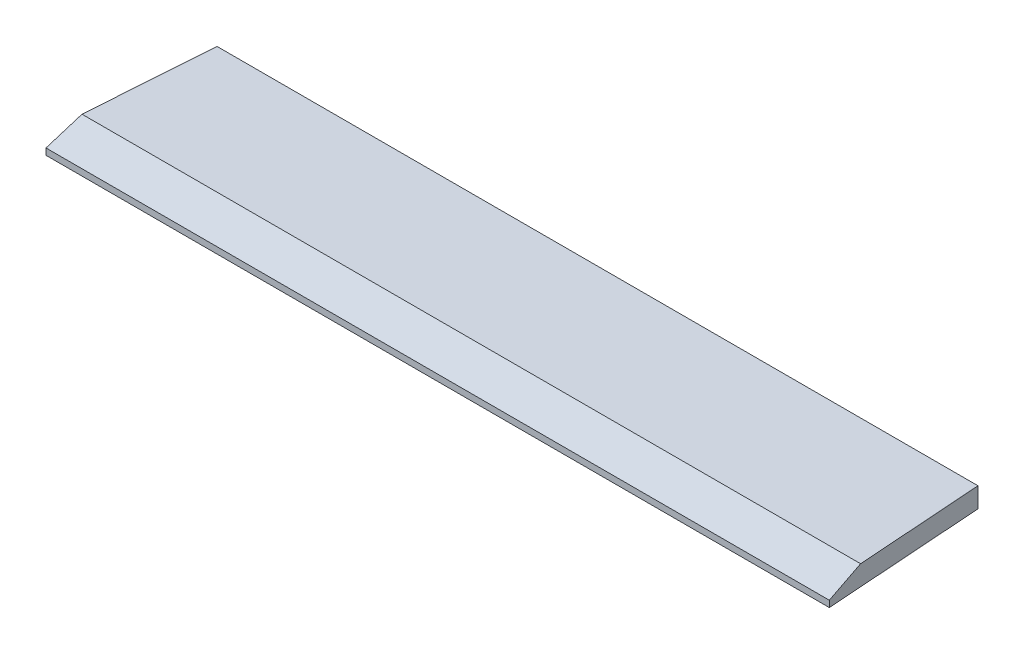
ISO-10303-21;
HEADER;
FILE_DESCRIPTION(('STEP AP214'),'2;1');
FILE_NAME('part.step','',(''),(''),'','','');
FILE_SCHEMA(('AUTOMOTIVE_DESIGN { 1 0 10303 214 1 1 1 1 }'));
ENDSEC;
DATA;
#1=APPLICATION_CONTEXT('core data for automotive mechanical design processes');
#2=APPLICATION_PROTOCOL_DEFINITION('international standard','automotive_design',2000,#1);
#3=PRODUCT_CONTEXT('',#1,'mechanical');
#4=PRODUCT('Part','Part','',(#3));
#5=PRODUCT_RELATED_PRODUCT_CATEGORY('part','',(#4));
#6=PRODUCT_DEFINITION_FORMATION('','',#4);
#7=PRODUCT_DEFINITION_CONTEXT('part definition',#1,'design');
#8=PRODUCT_DEFINITION('design','',#6,#7);
#9=PRODUCT_DEFINITION_SHAPE('','',#8);
#10=(LENGTH_UNIT() NAMED_UNIT(*) SI_UNIT(.MILLI.,.METRE.));
#11=(NAMED_UNIT(*) PLANE_ANGLE_UNIT() SI_UNIT($,.RADIAN.));
#12=(NAMED_UNIT(*) SI_UNIT($,.STERADIAN.) SOLID_ANGLE_UNIT());
#13=UNCERTAINTY_MEASURE_WITH_UNIT(LENGTH_MEASURE(1.E-05),#10,'distance_accuracy_value','');
#14=(GEOMETRIC_REPRESENTATION_CONTEXT(3) GLOBAL_UNCERTAINTY_ASSIGNED_CONTEXT((#13)) GLOBAL_UNIT_ASSIGNED_CONTEXT((#10,
#11,#12)) REPRESENTATION_CONTEXT('',''));
#15=CARTESIAN_POINT('',(0.,0.,0.));
#16=DIRECTION('',(0.,0.,1.));
#17=DIRECTION('',(1.,0.,0.));
#18=AXIS2_PLACEMENT_3D('',#15,#16,#17);
#19=CARTESIAN_POINT('',(490.,9.99999999999997,157.923523491922));
#20=DIRECTION('',(0.,-0.927183854566789,-0.374606593415907));
#21=DIRECTION('',(0.,0.374606593415907,-0.92718385456679));
#22=AXIS2_PLACEMENT_3D('',#19,#20,#21);
#23=PLANE('',#22);
#24=DIRECTION('',(-1.,0.,0.));
#25=VECTOR('',#24,1.);
#26=CARTESIAN_POINT('',(490.,-7.,200.));
#27=LINE('',#26,#25);
#28=CARTESIAN_POINT('',(490.,-7.,200.));
#29=VERTEX_POINT('',#28);
#30=CARTESIAN_POINT('',(-490.,-6.9999999999999,200.));
#31=VERTEX_POINT('',#30);
#32=EDGE_CURVE('E11',#29,#31,#27,.T.);
#33=ORIENTED_EDGE('',*,*,#32,.F.);
#34=DIRECTION('',(-0.0646991696164353,0.373821722859536,-0.925241231771083));
#35=VECTOR('',#34,1.);
#36=CARTESIAN_POINT('',(487.070042447007,9.92883829666601,158.099654888311));
#37=LINE('',#36,#35);
#38=CARTESIAN_POINT('',(487.057726139974,9.99999999999997,157.923523491922));
#39=VERTEX_POINT('',#38);
#40=EDGE_CURVE('E58',#29,#39,#37,.T.);
#41=ORIENTED_EDGE('',*,*,#40,.T.);
#42=DIRECTION('',(-1.,0.,0.));
#43=VECTOR('',#42,1.);
#44=CARTESIAN_POINT('',(490.,9.99999999999997,157.923523491922));
#45=LINE('',#44,#43);
#46=CARTESIAN_POINT('',(-487.057726139974,9.99999999999997,157.923523491922));
#47=VERTEX_POINT('',#46);
#48=EDGE_CURVE('E100',#39,#47,#45,.T.);
#49=ORIENTED_EDGE('',*,*,#48,.T.);
#50=DIRECTION('',(-0.0646991696164353,-0.373821722859536,0.925241231771083));
#51=VECTOR('',#50,1.);
#52=CARTESIAN_POINT('',(-482.967779548932,33.6310742491913,99.4345622856436));
#53=LINE('',#52,#51);
#54=EDGE_CURVE('E120',#47,#31,#53,.T.);
#55=ORIENTED_EDGE('',*,*,#54,.T.);
#56=EDGE_LOOP('',(#33,#41,#49,#55));
#57=FACE_BOUND('',#56,.T.);
#58=ADVANCED_FACE('F36',(#57),#23,.F.);
#59=CARTESIAN_POINT('',(490.,-7.,200.));
#60=DIRECTION('',(0.,0.,-1.));
#61=DIRECTION('',(-1.,0.,0.));
#62=AXIS2_PLACEMENT_3D('',#59,#60,#61);
#63=PLANE('',#62);
#64=DIRECTION('',(0.,-1.,0.));
#65=VECTOR('',#64,1.);
#66=CARTESIAN_POINT('',(-490.,-7.,200.));
#67=LINE('',#66,#65);
#68=CARTESIAN_POINT('',(-490.,-15.,200.));
#69=VERTEX_POINT('',#68);
#70=EDGE_CURVE('E88',#31,#69,#67,.T.);
#71=ORIENTED_EDGE('',*,*,#70,.T.);
#72=DIRECTION('',(-1.,0.,0.));
#73=VECTOR('',#72,1.);
#74=CARTESIAN_POINT('',(490.,-15.,200.));
#75=LINE('',#74,#73);
#76=CARTESIAN_POINT('',(490.,-14.9999999999999,200.));
#77=VERTEX_POINT('',#76);
#78=EDGE_CURVE('E43',#77,#69,#75,.T.);
#79=ORIENTED_EDGE('',*,*,#78,.F.);
#80=DIRECTION('',(0.,-1.,0.));
#81=VECTOR('',#80,1.);
#82=CARTESIAN_POINT('',(490.,-7.,200.));
#83=LINE('',#82,#81);
#84=EDGE_CURVE('E87',#29,#77,#83,.T.);
#85=ORIENTED_EDGE('',*,*,#84,.F.);
#86=ORIENTED_EDGE('',*,*,#32,.T.);
#87=EDGE_LOOP('',(#71,#79,#85,#86));
#88=FACE_BOUND('',#87,.T.);
#89=ADVANCED_FACE('F85',(#88),#63,.F.);
#90=CARTESIAN_POINT('',(490.,-15.,200.));
#91=DIRECTION('',(0.,1.,0.));
#92=DIRECTION('',(0.,0.,1.));
#93=AXIS2_PLACEMENT_3D('',#90,#91,#92);
#94=PLANE('',#93);
#95=DIRECTION('',(-1.,0.,0.));
#96=VECTOR('',#95,1.);
#97=CARTESIAN_POINT('',(490.,-15.,0.));
#98=LINE('',#97,#96);
#99=CARTESIAN_POINT('',(476.014637611299,-15.,0.));
#100=VERTEX_POINT('',#99);
#101=CARTESIAN_POINT('',(-476.014637611299,-14.9999999999999,0.));
#102=VERTEX_POINT('',#101);
#103=EDGE_CURVE('E91',#100,#102,#98,.T.);
#104=ORIENTED_EDGE('',*,*,#103,.F.);
#105=DIRECTION('',(0.0697564737441219,0.,0.997564050259825));
#106=VECTOR('',#105,1.);
#107=CARTESIAN_POINT('',(490.,-15.,200.));
#108=LINE('',#107,#106);
#109=EDGE_CURVE('E93',#100,#77,#108,.T.);
#110=ORIENTED_EDGE('',*,*,#109,.T.);
#111=ORIENTED_EDGE('',*,*,#78,.T.);
#112=DIRECTION('',(0.0697564737441219,0.,-0.997564050259825));
#113=VECTOR('',#112,1.);
#114=CARTESIAN_POINT('',(-485.23135368337,-15.,131.805180529571));
#115=LINE('',#114,#113);
#116=EDGE_CURVE('E104',#69,#102,#115,.T.);
#117=ORIENTED_EDGE('',*,*,#116,.T.);
#118=EDGE_LOOP('',(#104,#110,#111,#117));
#119=FACE_BOUND('',#118,.T.);
#120=ADVANCED_FACE('F94',(#119),#94,.F.);
#121=CARTESIAN_POINT('',(490.,-15.,0.));
#122=DIRECTION('',(0.,0.,1.));
#123=DIRECTION('',(1.,0.,0.));
#124=AXIS2_PLACEMENT_3D('',#121,#122,#123);
#125=PLANE('',#124);
#126=DIRECTION('',(-1.,0.,0.));
#127=VECTOR('',#126,1.);
#128=CARTESIAN_POINT('',(490.,10.,0.));
#129=LINE('',#128,#127);
#130=CARTESIAN_POINT('',(476.014637611299,10.,0.));
#131=VERTEX_POINT('',#130);
#132=CARTESIAN_POINT('',(-476.014637611299,10.,0.));
#133=VERTEX_POINT('',#132);
#134=EDGE_CURVE('E102',#131,#133,#129,.T.);
#135=ORIENTED_EDGE('',*,*,#134,.F.);
#136=DIRECTION('',(0.,-1.,0.));
#137=VECTOR('',#136,1.);
#138=CARTESIAN_POINT('',(476.014637611299,1263.14046092392,0.));
#139=LINE('',#138,#137);
#140=EDGE_CURVE('E50',#131,#100,#139,.T.);
#141=ORIENTED_EDGE('',*,*,#140,.T.);
#142=ORIENTED_EDGE('',*,*,#103,.T.);
#143=DIRECTION('',(0.,-1.,0.));
#144=VECTOR('',#143,1.);
#145=CARTESIAN_POINT('',(-476.014637611299,1259.39046092392,0.));
#146=LINE('',#145,#144);
#147=EDGE_CURVE('E96',#133,#102,#146,.T.);
#148=ORIENTED_EDGE('',*,*,#147,.F.);
#149=EDGE_LOOP('',(#135,#141,#142,#148));
#150=FACE_BOUND('',#149,.T.);
#151=ADVANCED_FACE('F112',(#150),#125,.F.);
#152=CARTESIAN_POINT('',(490.,10.,0.));
#153=DIRECTION('',(0.,-1.,0.));
#154=DIRECTION('',(0.,0.,-1.));
#155=AXIS2_PLACEMENT_3D('',#152,#153,#154);
#156=PLANE('',#155);
#157=ORIENTED_EDGE('',*,*,#48,.F.);
#158=DIRECTION('',(-0.0697564737441219,0.,-0.997564050259825));
#159=VECTOR('',#158,1.);
#160=CARTESIAN_POINT('',(476.082689903994,10.,0.973193125842875));
#161=LINE('',#160,#159);
#162=EDGE_CURVE('E125',#39,#131,#161,.T.);
#163=ORIENTED_EDGE('',*,*,#162,.T.);
#164=ORIENTED_EDGE('',*,*,#134,.T.);
#165=DIRECTION('',(-0.0697564737441219,0.,0.997564050259825));
#166=VECTOR('',#165,1.);
#167=CARTESIAN_POINT('',(-471.314043587364,10.,-67.2216263445859));
#168=LINE('',#167,#166);
#169=EDGE_CURVE('E118',#133,#47,#168,.T.);
#170=ORIENTED_EDGE('',*,*,#169,.T.);
#171=EDGE_LOOP('',(#157,#163,#164,#170));
#172=FACE_BOUND('',#171,.T.);
#173=ADVANCED_FACE('F128',(#172),#156,.F.);
#174=CARTESIAN_POINT('',(-476.014637611299,1259.39046092392,0.));
#175=DIRECTION('',(0.997564050259824,0.,0.0697564737441219));
#176=DIRECTION('',(0.0697564737441219,0.,-0.997564050259825));
#177=AXIS2_PLACEMENT_3D('',#174,#175,#176);
#178=PLANE('',#177);
#179=ORIENTED_EDGE('',*,*,#116,.F.);
#180=ORIENTED_EDGE('',*,*,#70,.F.);
#181=ORIENTED_EDGE('',*,*,#54,.F.);
#182=ORIENTED_EDGE('',*,*,#169,.F.);
#183=ORIENTED_EDGE('',*,*,#147,.T.);
#184=EDGE_LOOP('',(#179,#180,#181,#182,#183));
#185=FACE_BOUND('',#184,.T.);
#186=ADVANCED_FACE('F115',(#185),#178,.F.);
#187=CARTESIAN_POINT('',(490.,1263.14046092392,200.));
#188=DIRECTION('',(-0.997564050259825,0.,0.0697564737441219));
#189=DIRECTION('',(0.0697564737441219,0.,0.997564050259825));
#190=AXIS2_PLACEMENT_3D('',#187,#188,#189);
#191=PLANE('',#190);
#192=ORIENTED_EDGE('',*,*,#109,.F.);
#193=ORIENTED_EDGE('',*,*,#140,.F.);
#194=ORIENTED_EDGE('',*,*,#162,.F.);
#195=ORIENTED_EDGE('',*,*,#40,.F.);
#196=ORIENTED_EDGE('',*,*,#84,.T.);
#197=EDGE_LOOP('',(#192,#193,#194,#195,#196));
#198=FACE_BOUND('',#197,.T.);
#199=ADVANCED_FACE('F98',(#198),#191,.F.);
#200=CLOSED_SHELL('',(#58,#89,#120,#151,#173,#186,#199));
#201=MANIFOLD_SOLID_BREP('B2',#200);
#202=ADVANCED_BREP_SHAPE_REPRESENTATION('',(#18,#201),#14);
#203=SHAPE_DEFINITION_REPRESENTATION(#9,#202);
ENDSEC;
END-ISO-10303-21;
